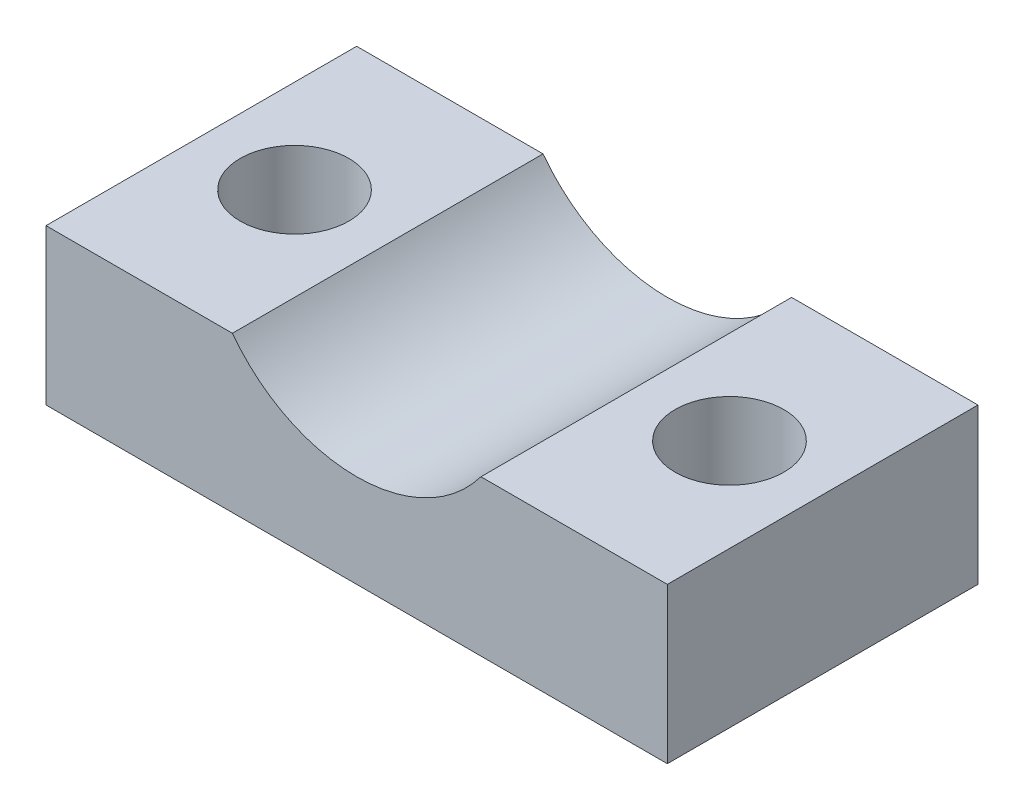
ISO-10303-21;
HEADER;
FILE_DESCRIPTION(('STEP AP214'),'2;1');
FILE_NAME('part.step','',(''),(''),'','','');
FILE_SCHEMA(('AUTOMOTIVE_DESIGN { 1 0 10303 214 1 1 1 1 }'));
ENDSEC;
DATA;
#1=APPLICATION_CONTEXT('core data for automotive mechanical design processes');
#2=APPLICATION_PROTOCOL_DEFINITION('international standard','automotive_design',2000,#1);
#3=PRODUCT_CONTEXT('',#1,'mechanical');
#4=PRODUCT('Part','Part','',(#3));
#5=PRODUCT_RELATED_PRODUCT_CATEGORY('part','',(#4));
#6=PRODUCT_DEFINITION_FORMATION('','',#4);
#7=PRODUCT_DEFINITION_CONTEXT('part definition',#1,'design');
#8=PRODUCT_DEFINITION('design','',#6,#7);
#9=PRODUCT_DEFINITION_SHAPE('','',#8);
#10=(LENGTH_UNIT() NAMED_UNIT(*) SI_UNIT(.MILLI.,.METRE.));
#11=(NAMED_UNIT(*) PLANE_ANGLE_UNIT() SI_UNIT($,.RADIAN.));
#12=(NAMED_UNIT(*) SI_UNIT($,.STERADIAN.) SOLID_ANGLE_UNIT());
#13=UNCERTAINTY_MEASURE_WITH_UNIT(LENGTH_MEASURE(1.E-05),#10,'distance_accuracy_value','');
#14=(GEOMETRIC_REPRESENTATION_CONTEXT(3) GLOBAL_UNCERTAINTY_ASSIGNED_CONTEXT((#13)) GLOBAL_UNIT_ASSIGNED_CONTEXT((#10,
#11,#12)) REPRESENTATION_CONTEXT('',''));
#15=CARTESIAN_POINT('',(0.,0.,0.));
#16=DIRECTION('',(0.,0.,1.));
#17=DIRECTION('',(1.,0.,0.));
#18=AXIS2_PLACEMENT_3D('',#15,#16,#17);
#19=CARTESIAN_POINT('',(0.,0.,10.));
#20=DIRECTION('',(1.,0.,0.));
#21=DIRECTION('',(0.,1.,0.));
#22=AXIS2_PLACEMENT_3D('',#19,#20,#21);
#23=PLANE('',#22);
#24=DIRECTION('',(0.,-1.,0.));
#25=VECTOR('',#24,1.);
#26=CARTESIAN_POINT('',(0.,0.,0.));
#27=LINE('',#26,#25);
#28=CARTESIAN_POINT('',(0.,5.,0.));
#29=VERTEX_POINT('',#28);
#30=CARTESIAN_POINT('',(0.,0.,0.));
#31=VERTEX_POINT('',#30);
#32=EDGE_CURVE('E118',#29,#31,#27,.T.);
#33=ORIENTED_EDGE('',*,*,#32,.T.);
#34=DIRECTION('',(0.,0.,-1.));
#35=VECTOR('',#34,1.);
#36=CARTESIAN_POINT('',(0.,0.,10.));
#37=LINE('',#36,#35);
#38=CARTESIAN_POINT('',(0.,0.,10.));
#39=VERTEX_POINT('',#38);
#40=EDGE_CURVE('E11',#39,#31,#37,.T.);
#41=ORIENTED_EDGE('',*,*,#40,.F.);
#42=DIRECTION('',(0.,-1.,0.));
#43=VECTOR('',#42,1.);
#44=CARTESIAN_POINT('',(0.,0.,10.));
#45=LINE('',#44,#43);
#46=CARTESIAN_POINT('',(0.,5.,10.));
#47=VERTEX_POINT('',#46);
#48=EDGE_CURVE('E129',#47,#39,#45,.T.);
#49=ORIENTED_EDGE('',*,*,#48,.F.);
#50=DIRECTION('',(0.,0.,-1.));
#51=VECTOR('',#50,1.);
#52=CARTESIAN_POINT('',(0.,5.,10.));
#53=LINE('',#52,#51);
#54=EDGE_CURVE('E114',#47,#29,#53,.T.);
#55=ORIENTED_EDGE('',*,*,#54,.T.);
#56=EDGE_LOOP('',(#33,#41,#49,#55));
#57=FACE_BOUND('',#56,.T.);
#58=ADVANCED_FACE('F34',(#57),#23,.F.);
#59=CARTESIAN_POINT('',(0.,0.,10.));
#60=DIRECTION('',(0.,1.,0.));
#61=DIRECTION('',(0.,0.,1.));
#62=AXIS2_PLACEMENT_3D('',#59,#60,#61);
#63=PLANE('',#62);
#64=CARTESIAN_POINT('',(17.,0.,5.));
#65=DIRECTION('',(0.,1.,0.));
#66=DIRECTION('',(0.,0.,1.));
#67=AXIS2_PLACEMENT_3D('',#64,#65,#66);
#68=CIRCLE('',#67,1.75);
#69=CARTESIAN_POINT('',(17.,0.,6.75));
#70=VERTEX_POINT('',#69);
#71=EDGE_CURVE('E175',#70,#70,#68,.T.);
#72=ORIENTED_EDGE('',*,*,#71,.T.);
#73=EDGE_LOOP('',(#72));
#74=FACE_BOUND('',#73,.T.);
#75=CARTESIAN_POINT('',(3.,0.,5.));
#76=DIRECTION('',(0.,1.,0.));
#77=DIRECTION('',(0.,0.,1.));
#78=AXIS2_PLACEMENT_3D('',#75,#76,#77);
#79=CIRCLE('',#78,1.75);
#80=CARTESIAN_POINT('',(3.,0.,6.75));
#81=VERTEX_POINT('',#80);
#82=EDGE_CURVE('E122',#81,#81,#79,.T.);
#83=ORIENTED_EDGE('',*,*,#82,.T.);
#84=EDGE_LOOP('',(#83));
#85=FACE_BOUND('',#84,.T.);
#86=DIRECTION('',(1.,0.,0.));
#87=VECTOR('',#86,1.);
#88=CARTESIAN_POINT('',(0.,0.,0.));
#89=LINE('',#88,#87);
#90=CARTESIAN_POINT('',(20.,0.,0.));
#91=VERTEX_POINT('',#90);
#92=EDGE_CURVE('E121',#31,#91,#89,.T.);
#93=ORIENTED_EDGE('',*,*,#92,.T.);
#94=DIRECTION('',(0.,0.,-1.));
#95=VECTOR('',#94,1.);
#96=CARTESIAN_POINT('',(20.,0.,10.));
#97=LINE('',#96,#95);
#98=CARTESIAN_POINT('',(20.,0.,10.));
#99=VERTEX_POINT('',#98);
#100=EDGE_CURVE('E42',#99,#91,#97,.T.);
#101=ORIENTED_EDGE('',*,*,#100,.F.);
#102=DIRECTION('',(1.,0.,0.));
#103=VECTOR('',#102,1.);
#104=CARTESIAN_POINT('',(0.,0.,10.));
#105=LINE('',#104,#103);
#106=EDGE_CURVE('E87',#39,#99,#105,.T.);
#107=ORIENTED_EDGE('',*,*,#106,.F.);
#108=ORIENTED_EDGE('',*,*,#40,.T.);
#109=EDGE_LOOP('',(#93,#101,#107,#108));
#110=FACE_BOUND('',#109,.T.);
#111=ADVANCED_FACE('F155',(#74,#85,#110),#63,.F.);
#112=CARTESIAN_POINT('',(20.,0.,10.));
#113=DIRECTION('',(-1.,0.,0.));
#114=DIRECTION('',(0.,0.,1.));
#115=AXIS2_PLACEMENT_3D('',#112,#113,#114);
#116=PLANE('',#115);
#117=DIRECTION('',(0.,1.,0.));
#118=VECTOR('',#117,1.);
#119=CARTESIAN_POINT('',(20.,0.,0.));
#120=LINE('',#119,#118);
#121=CARTESIAN_POINT('',(20.,5.,0.));
#122=VERTEX_POINT('',#121);
#123=EDGE_CURVE('E124',#91,#122,#120,.T.);
#124=ORIENTED_EDGE('',*,*,#123,.T.);
#125=DIRECTION('',(0.,0.,-1.));
#126=VECTOR('',#125,1.);
#127=CARTESIAN_POINT('',(20.,5.,10.));
#128=LINE('',#127,#126);
#129=CARTESIAN_POINT('',(20.,5.,10.));
#130=VERTEX_POINT('',#129);
#131=EDGE_CURVE('E109',#130,#122,#128,.T.);
#132=ORIENTED_EDGE('',*,*,#131,.F.);
#133=DIRECTION('',(0.,1.,0.));
#134=VECTOR('',#133,1.);
#135=CARTESIAN_POINT('',(20.,0.,10.));
#136=LINE('',#135,#134);
#137=EDGE_CURVE('E100',#99,#130,#136,.T.);
#138=ORIENTED_EDGE('',*,*,#137,.F.);
#139=ORIENTED_EDGE('',*,*,#100,.T.);
#140=EDGE_LOOP('',(#124,#132,#138,#139));
#141=FACE_BOUND('',#140,.T.);
#142=ADVANCED_FACE('F135',(#141),#116,.F.);
#143=CARTESIAN_POINT('',(20.,5.,10.));
#144=DIRECTION('',(0.,-1.,0.));
#145=DIRECTION('',(0.,0.,-1.));
#146=AXIS2_PLACEMENT_3D('',#143,#144,#145);
#147=PLANE('',#146);
#148=CARTESIAN_POINT('',(17.,5.,5.));
#149=DIRECTION('',(0.,1.,0.));
#150=DIRECTION('',(0.,0.,1.));
#151=AXIS2_PLACEMENT_3D('',#148,#149,#150);
#152=CIRCLE('',#151,1.75);
#153=CARTESIAN_POINT('',(17.,5.,6.75));
#154=VERTEX_POINT('',#153);
#155=EDGE_CURVE('E173',#154,#154,#152,.T.);
#156=ORIENTED_EDGE('',*,*,#155,.F.);
#157=EDGE_LOOP('',(#156));
#158=FACE_BOUND('',#157,.T.);
#159=DIRECTION('',(-1.,0.,0.));
#160=VECTOR('',#159,1.);
#161=CARTESIAN_POINT('',(20.,5.,0.));
#162=LINE('',#161,#160);
#163=CARTESIAN_POINT('',(14.,5.,0.));
#164=VERTEX_POINT('',#163);
#165=EDGE_CURVE('E108',#122,#164,#162,.T.);
#166=ORIENTED_EDGE('',*,*,#165,.T.);
#167=DIRECTION('',(0.,0.,-1.));
#168=VECTOR('',#167,1.);
#169=CARTESIAN_POINT('',(14.,5.,10.));
#170=LINE('',#169,#168);
#171=CARTESIAN_POINT('',(14.,5.,10.));
#172=VERTEX_POINT('',#171);
#173=EDGE_CURVE('E105',#172,#164,#170,.T.);
#174=ORIENTED_EDGE('',*,*,#173,.F.);
#175=DIRECTION('',(-1.,0.,0.));
#176=VECTOR('',#175,1.);
#177=CARTESIAN_POINT('',(20.,5.,10.));
#178=LINE('',#177,#176);
#179=EDGE_CURVE('E94',#130,#172,#178,.T.);
#180=ORIENTED_EDGE('',*,*,#179,.F.);
#181=ORIENTED_EDGE('',*,*,#131,.T.);
#182=EDGE_LOOP('',(#166,#174,#180,#181));
#183=FACE_BOUND('',#182,.T.);
#184=ADVANCED_FACE('F106',(#158,#183),#147,.F.);
#185=CARTESIAN_POINT('',(10.,8.,10.));
#186=DIRECTION('',(0.,0.,-1.));
#187=DIRECTION('',(-1.,0.,0.));
#188=AXIS2_PLACEMENT_3D('',#185,#186,#187);
#189=CYLINDRICAL_SURFACE('',#188,5.);
#190=CARTESIAN_POINT('',(10.,8.,0.));
#191=DIRECTION('',(0.,0.,-1.));
#192=DIRECTION('',(1.,0.,0.));
#193=AXIS2_PLACEMENT_3D('',#190,#191,#192);
#194=CIRCLE('',#193,5.);
#195=CARTESIAN_POINT('',(6.,5.,0.));
#196=VERTEX_POINT('',#195);
#197=EDGE_CURVE('E73',#164,#196,#194,.T.);
#198=ORIENTED_EDGE('',*,*,#197,.T.);
#199=DIRECTION('',(0.,0.,-1.));
#200=VECTOR('',#199,1.);
#201=CARTESIAN_POINT('',(6.,5.,10.));
#202=LINE('',#201,#200);
#203=CARTESIAN_POINT('',(6.,5.,10.));
#204=VERTEX_POINT('',#203);
#205=EDGE_CURVE('E110',#204,#196,#202,.T.);
#206=ORIENTED_EDGE('',*,*,#205,.F.);
#207=CARTESIAN_POINT('',(10.,8.,10.));
#208=DIRECTION('',(0.,0.,-1.));
#209=DIRECTION('',(1.,0.,0.));
#210=AXIS2_PLACEMENT_3D('',#207,#208,#209);
#211=CIRCLE('',#210,5.);
#212=EDGE_CURVE('E98',#172,#204,#211,.T.);
#213=ORIENTED_EDGE('',*,*,#212,.F.);
#214=ORIENTED_EDGE('',*,*,#173,.T.);
#215=EDGE_LOOP('',(#198,#206,#213,#214));
#216=FACE_BOUND('',#215,.T.);
#217=ADVANCED_FACE('F112',(#216),#189,.F.);
#218=CARTESIAN_POINT('',(0.,5.,10.));
#219=DIRECTION('',(0.,-1.,0.));
#220=DIRECTION('',(0.,0.,-1.));
#221=AXIS2_PLACEMENT_3D('',#218,#219,#220);
#222=PLANE('',#221);
#223=CARTESIAN_POINT('',(3.,5.,5.));
#224=DIRECTION('',(0.,1.,0.));
#225=DIRECTION('',(0.,0.,1.));
#226=AXIS2_PLACEMENT_3D('',#223,#224,#225);
#227=CIRCLE('',#226,1.75);
#228=CARTESIAN_POINT('',(3.,5.,6.75));
#229=VERTEX_POINT('',#228);
#230=EDGE_CURVE('E177',#229,#229,#227,.T.);
#231=ORIENTED_EDGE('',*,*,#230,.F.);
#232=EDGE_LOOP('',(#231));
#233=FACE_BOUND('',#232,.T.);
#234=DIRECTION('',(-1.,0.,0.));
#235=VECTOR('',#234,1.);
#236=CARTESIAN_POINT('',(0.,5.,0.));
#237=LINE('',#236,#235);
#238=EDGE_CURVE('E79',#196,#29,#237,.T.);
#239=ORIENTED_EDGE('',*,*,#238,.T.);
#240=ORIENTED_EDGE('',*,*,#54,.F.);
#241=DIRECTION('',(-1.,0.,0.));
#242=VECTOR('',#241,1.);
#243=CARTESIAN_POINT('',(0.,5.,10.));
#244=LINE('',#243,#242);
#245=EDGE_CURVE('E50',#204,#47,#244,.T.);
#246=ORIENTED_EDGE('',*,*,#245,.F.);
#247=ORIENTED_EDGE('',*,*,#205,.T.);
#248=EDGE_LOOP('',(#239,#240,#246,#247));
#249=FACE_BOUND('',#248,.T.);
#250=ADVANCED_FACE('F142',(#233,#249),#222,.F.);
#251=CARTESIAN_POINT('',(10.,8.,10.));
#252=DIRECTION('',(0.,0.,1.));
#253=DIRECTION('',(1.,0.,0.));
#254=AXIS2_PLACEMENT_3D('',#251,#252,#253);
#255=PLANE('',#254);
#256=ORIENTED_EDGE('',*,*,#48,.T.);
#257=ORIENTED_EDGE('',*,*,#106,.T.);
#258=ORIENTED_EDGE('',*,*,#137,.T.);
#259=ORIENTED_EDGE('',*,*,#179,.T.);
#260=ORIENTED_EDGE('',*,*,#212,.T.);
#261=ORIENTED_EDGE('',*,*,#245,.T.);
#262=EDGE_LOOP('',(#256,#257,#258,#259,#260,#261));
#263=FACE_BOUND('',#262,.T.);
#264=ADVANCED_FACE('F96',(#263),#255,.T.);
#265=CARTESIAN_POINT('',(10.,8.,0.));
#266=DIRECTION('',(0.,0.,1.));
#267=DIRECTION('',(1.,0.,0.));
#268=AXIS2_PLACEMENT_3D('',#265,#266,#267);
#269=PLANE('',#268);
#270=ORIENTED_EDGE('',*,*,#32,.F.);
#271=ORIENTED_EDGE('',*,*,#238,.F.);
#272=ORIENTED_EDGE('',*,*,#197,.F.);
#273=ORIENTED_EDGE('',*,*,#165,.F.);
#274=ORIENTED_EDGE('',*,*,#123,.F.);
#275=ORIENTED_EDGE('',*,*,#92,.F.);
#276=EDGE_LOOP('',(#270,#271,#272,#273,#274,#275));
#277=FACE_BOUND('',#276,.T.);
#278=ADVANCED_FACE('F138',(#277),#269,.F.);
#279=CARTESIAN_POINT('',(3.,0.,5.));
#280=DIRECTION('',(0.,1.,0.));
#281=DIRECTION('',(0.,0.,1.));
#282=AXIS2_PLACEMENT_3D('',#279,#280,#281);
#283=CYLINDRICAL_SURFACE('',#282,1.75);
#284=ORIENTED_EDGE('',*,*,#82,.F.);
#285=EDGE_LOOP('',(#284));
#286=FACE_BOUND('',#285,.T.);
#287=ORIENTED_EDGE('',*,*,#230,.T.);
#288=EDGE_LOOP('',(#287));
#289=FACE_BOUND('',#288,.T.);
#290=ADVANCED_FACE('F186',(#286,#289),#283,.F.);
#291=CARTESIAN_POINT('',(17.,0.,5.));
#292=DIRECTION('',(0.,1.,0.));
#293=DIRECTION('',(0.,0.,1.));
#294=AXIS2_PLACEMENT_3D('',#291,#292,#293);
#295=CYLINDRICAL_SURFACE('',#294,1.75);
#296=ORIENTED_EDGE('',*,*,#71,.F.);
#297=EDGE_LOOP('',(#296));
#298=FACE_BOUND('',#297,.T.);
#299=ORIENTED_EDGE('',*,*,#155,.T.);
#300=EDGE_LOOP('',(#299));
#301=FACE_BOUND('',#300,.T.);
#302=ADVANCED_FACE('F188',(#298,#301),#295,.F.);
#303=CLOSED_SHELL('',(#58,#111,#142,#184,#217,#250,#264,#278,#290,#302));
#304=MANIFOLD_SOLID_BREP('B2',#303);
#305=ADVANCED_BREP_SHAPE_REPRESENTATION('',(#18,#304),#14);
#306=SHAPE_DEFINITION_REPRESENTATION(#9,#305);
ENDSEC;
END-ISO-10303-21;
